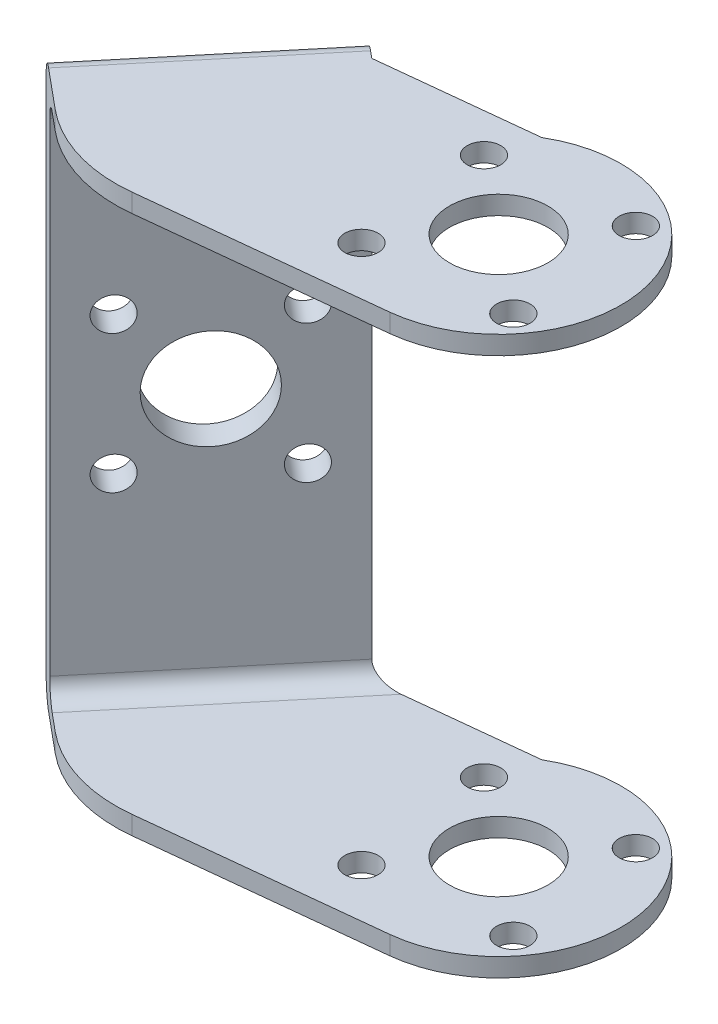
ISO-10303-21;
HEADER;
FILE_DESCRIPTION(('STEP AP214'),'2;1');
FILE_NAME('part.step','',(''),(''),'','','');
FILE_SCHEMA(('AUTOMOTIVE_DESIGN { 1 0 10303 214 1 1 1 1 }'));
ENDSEC;
DATA;
#1=APPLICATION_CONTEXT('core data for automotive mechanical design processes');
#2=APPLICATION_PROTOCOL_DEFINITION('international standard','automotive_design',2000,#1);
#3=PRODUCT_CONTEXT('',#1,'mechanical');
#4=PRODUCT('Part','Part','',(#3));
#5=PRODUCT_RELATED_PRODUCT_CATEGORY('part','',(#4));
#6=PRODUCT_DEFINITION_FORMATION('','',#4);
#7=PRODUCT_DEFINITION_CONTEXT('part definition',#1,'design');
#8=PRODUCT_DEFINITION('design','',#6,#7);
#9=PRODUCT_DEFINITION_SHAPE('','',#8);
#10=(LENGTH_UNIT() NAMED_UNIT(*) SI_UNIT(.MILLI.,.METRE.));
#11=(NAMED_UNIT(*) PLANE_ANGLE_UNIT() SI_UNIT($,.RADIAN.));
#12=(NAMED_UNIT(*) SI_UNIT($,.STERADIAN.) SOLID_ANGLE_UNIT());
#13=UNCERTAINTY_MEASURE_WITH_UNIT(LENGTH_MEASURE(1.E-05),#10,'distance_accuracy_value','');
#14=(GEOMETRIC_REPRESENTATION_CONTEXT(3) GLOBAL_UNCERTAINTY_ASSIGNED_CONTEXT((#13)) GLOBAL_UNIT_ASSIGNED_CONTEXT((#10,
#11,#12)) REPRESENTATION_CONTEXT('',''));
#15=CARTESIAN_POINT('',(0.,0.,0.));
#16=DIRECTION('',(0.,0.,1.));
#17=DIRECTION('',(1.,0.,0.));
#18=AXIS2_PLACEMENT_3D('',#15,#16,#17);
#19=CARTESIAN_POINT('',(-10.9502887226159,0.,-9.10426289269159));
#20=DIRECTION('',(0.768945255906317,0.,0.6393146278783));
#21=DIRECTION('',(0.6393146278783,0.,-0.768945255906317));
#22=AXIS2_PLACEMENT_3D('',#19,#20,#21);
#23=PLANE('',#22);
#24=CARTESIAN_POINT('',(-13.6738232846157,37.4246212024587,-5.82849085585136));
#25=DIRECTION('',(0.768945255906317,0.,0.6393146278783));
#26=DIRECTION('',(0.6393146278783,0.,-0.768945255906317));
#27=AXIS2_PLACEMENT_3D('',#24,#25,#26);
#28=CIRCLE('',#27,1.8);
#29=CARTESIAN_POINT('',(-12.5230569544348,37.4246212024587,-7.21259231648273));
#30=VERTEX_POINT('',#29);
#31=EDGE_CURVE('E371',#30,#30,#28,.F.);
#32=ORIENTED_EDGE('',*,*,#31,.T.);
#33=EDGE_LOOP('',(#32));
#34=FACE_BOUND('',#33,.T.);
#35=CARTESIAN_POINT('',(-13.6738232846157,22.5753787975412,-5.82849085585134));
#36=DIRECTION('',(0.768945255906317,0.,0.6393146278783));
#37=DIRECTION('',(0.6393146278783,0.,-0.768945255906317));
#38=AXIS2_PLACEMENT_3D('',#35,#36,#37);
#39=CIRCLE('',#38,1.8);
#40=CARTESIAN_POINT('',(-12.5230569544348,22.5753787975412,-7.21259231648271));
#41=VERTEX_POINT('',#40);
#42=EDGE_CURVE('E380',#41,#41,#39,.F.);
#43=ORIENTED_EDGE('',*,*,#42,.T.);
#44=EDGE_LOOP('',(#43));
#45=FACE_BOUND('',#44,.T.);
#46=CARTESIAN_POINT('',(-23.1671611669902,22.5753787975413,5.58976364521287));
#47=DIRECTION('',(0.768945255906317,0.,0.6393146278783));
#48=DIRECTION('',(0.6393146278783,0.,-0.768945255906317));
#49=AXIS2_PLACEMENT_3D('',#46,#47,#48);
#50=CIRCLE('',#49,1.8);
#51=CARTESIAN_POINT('',(-22.0163948368093,22.5753787975413,4.2056621845815));
#52=VERTEX_POINT('',#51);
#53=EDGE_CURVE('E383',#52,#52,#50,.F.);
#54=ORIENTED_EDGE('',*,*,#53,.T.);
#55=EDGE_LOOP('',(#54));
#56=FACE_BOUND('',#55,.T.);
#57=CARTESIAN_POINT('',(-23.1671611669902,37.4246212024588,5.58976364521286));
#58=DIRECTION('',(0.768945255906317,0.,0.6393146278783));
#59=DIRECTION('',(0.6393146278783,0.,-0.768945255906317));
#60=AXIS2_PLACEMENT_3D('',#57,#58,#59);
#61=CIRCLE('',#60,1.8);
#62=CARTESIAN_POINT('',(-22.0163948368093,37.4246212024588,4.20566218458149));
#63=VERTEX_POINT('',#62);
#64=EDGE_CURVE('E386',#63,#63,#61,.F.);
#65=ORIENTED_EDGE('',*,*,#64,.T.);
#66=EDGE_LOOP('',(#65));
#67=FACE_BOUND('',#66,.T.);
#68=CARTESIAN_POINT('',(-18.420492225803,30.,-0.119363605319243));
#69=DIRECTION('',(0.768945255906317,0.,0.6393146278783));
#70=DIRECTION('',(0.6393146278783,0.,-0.768945255906317));
#71=AXIS2_PLACEMENT_3D('',#68,#69,#70);
#72=CIRCLE('',#71,5.39999999999999);
#73=CARTESIAN_POINT('',(-14.9681932352602,30.,-4.27166798721335));
#74=VERTEX_POINT('',#73);
#75=EDGE_CURVE('E389',#74,#74,#72,.F.);
#76=ORIENTED_EDGE('',*,*,#75,.T.);
#77=EDGE_LOOP('',(#76));
#78=FACE_BOUND('',#77,.T.);
#79=DIRECTION('',(0.,-1.,0.));
#80=VECTOR('',#79,1.);
#81=CARTESIAN_POINT('',(-10.5537257297605,0.,-9.58123497924646));
#82=LINE('',#81,#80);
#83=CARTESIAN_POINT('',(-10.5537257297605,56.,-9.58123497924646));
#84=VERTEX_POINT('',#83);
#85=CARTESIAN_POINT('',(-10.5537257297605,4.,-9.58123497924646));
#86=VERTEX_POINT('',#85);
#87=EDGE_CURVE('E195',#84,#86,#82,.T.);
#88=ORIENTED_EDGE('',*,*,#87,.F.);
#89=DIRECTION('',(-0.6393146278783,0.,0.768945255906317));
#90=VECTOR('',#89,1.);
#91=CARTESIAN_POINT('',(-10.9502887226159,56.,-9.10426289269159));
#92=LINE('',#91,#90);
#93=CARTESIAN_POINT('',(-26.2872587218455,56.,9.34250776860799));
#94=VERTEX_POINT('',#93);
#95=EDGE_CURVE('E300',#84,#94,#92,.T.);
#96=ORIENTED_EDGE('',*,*,#95,.T.);
#97=DIRECTION('',(0.,1.,0.));
#98=VECTOR('',#97,1.);
#99=CARTESIAN_POINT('',(-26.2872587218455,0.,9.34250776860799));
#100=LINE('',#99,#98);
#101=CARTESIAN_POINT('',(-26.2872587218455,4.,9.34250776860799));
#102=VERTEX_POINT('',#101);
#103=EDGE_CURVE('E201',#102,#94,#100,.T.);
#104=ORIENTED_EDGE('',*,*,#103,.F.);
#105=DIRECTION('',(-0.6393146278783,0.,0.768945255906317));
#106=VECTOR('',#105,1.);
#107=CARTESIAN_POINT('',(-10.5537257297605,4.,-9.58123497924646));
#108=LINE('',#107,#106);
#109=EDGE_CURVE('E297',#102,#86,#108,.F.);
#110=ORIENTED_EDGE('',*,*,#109,.T.);
#111=EDGE_LOOP('',(#88,#96,#104,#110));
#112=FACE_BOUND('',#111,.T.);
#113=ADVANCED_FACE('F32',(#34,#45,#56,#67,#78,#112),#23,.T.);
#114=CARTESIAN_POINT('',(-12.685,2.,0.));
#115=DIRECTION('',(0.,1.,0.));
#116=DIRECTION('',(0.,0.,1.));
#117=AXIS2_PLACEMENT_3D('',#114,#115,#116);
#118=PLANE('',#117);
#119=CARTESIAN_POINT('',(4.51238048285324,2.,-6.59229021114451));
#120=DIRECTION('',(0.,1.,0.));
#121=DIRECTION('',(0.,0.,1.));
#122=AXIS2_PLACEMENT_3D('',#119,#120,#121);
#123=CIRCLE('',#122,1.8);
#124=CARTESIAN_POINT('',(4.51238048285324,2.,-4.79229021114451));
#125=VERTEX_POINT('',#124);
#126=EDGE_CURVE('E210',#125,#125,#123,.T.);
#127=ORIENTED_EDGE('',*,*,#126,.F.);
#128=EDGE_LOOP('',(#127));
#129=FACE_BOUND('',#128,.T.);
#130=CARTESIAN_POINT('',(19.2772902111445,2.,-8.17261951714677));
#131=DIRECTION('',(0.,1.,0.));
#132=DIRECTION('',(0.,0.,1.));
#133=AXIS2_PLACEMENT_3D('',#130,#131,#132);
#134=CIRCLE('',#133,1.8);
#135=CARTESIAN_POINT('',(19.2772902111445,2.,-6.37261951714677));
#136=VERTEX_POINT('',#135);
#137=EDGE_CURVE('E214',#136,#136,#134,.T.);
#138=ORIENTED_EDGE('',*,*,#137,.F.);
#139=EDGE_LOOP('',(#138));
#140=FACE_BOUND('',#139,.T.);
#141=CARTESIAN_POINT('',(20.8576195171468,2.,6.5922902111445));
#142=DIRECTION('',(0.,1.,0.));
#143=DIRECTION('',(0.,0.,1.));
#144=AXIS2_PLACEMENT_3D('',#141,#142,#143);
#145=CIRCLE('',#144,1.8);
#146=CARTESIAN_POINT('',(20.8576195171468,2.,8.3922902111445));
#147=VERTEX_POINT('',#146);
#148=EDGE_CURVE('E220',#147,#147,#145,.T.);
#149=ORIENTED_EDGE('',*,*,#148,.F.);
#150=EDGE_LOOP('',(#149));
#151=FACE_BOUND('',#150,.T.);
#152=CARTESIAN_POINT('',(6.09270978885549,2.,8.17261951714677));
#153=DIRECTION('',(0.,1.,0.));
#154=DIRECTION('',(0.,0.,1.));
#155=AXIS2_PLACEMENT_3D('',#152,#153,#154);
#156=CIRCLE('',#155,1.8);
#157=CARTESIAN_POINT('',(6.09270978885549,2.,9.97261951714676));
#158=VERTEX_POINT('',#157);
#159=EDGE_CURVE('E226',#158,#158,#156,.T.);
#160=ORIENTED_EDGE('',*,*,#159,.F.);
#161=EDGE_LOOP('',(#160));
#162=FACE_BOUND('',#161,.T.);
#163=DIRECTION('',(-0.994320742141141,0.,0.106424911312576));
#164=VECTOR('',#163,1.);
#165=CARTESIAN_POINT('',(-10.5537257297605,2.,-9.58123497924646));
#166=LINE('',#165,#164);
#167=CARTESIAN_POINT('',(5.98794999616358,2.,-11.3517364859353));
#168=VERTEX_POINT('',#167);
#169=CARTESIAN_POINT('',(-7.69869410826487,2.,-9.88681694514005));
#170=VERTEX_POINT('',#169);
#171=EDGE_CURVE('E249',#168,#170,#166,.T.);
#172=ORIENTED_EDGE('',*,*,#171,.T.);
#173=DIRECTION('',(-0.6393146278783,0.,0.768945255906317));
#174=VECTOR('',#173,1.);
#175=CARTESIAN_POINT('',(-24.7493682100328,2.,10.6211370243646));
#176=LINE('',#175,#174);
#177=CARTESIAN_POINT('',(-24.7493682100328,2.,10.6211370243646));
#178=VERTEX_POINT('',#177);
#179=EDGE_CURVE('E304',#170,#178,#176,.T.);
#180=ORIENTED_EDGE('',*,*,#179,.T.);
#181=DIRECTION('',(0.768945255906318,0.,0.639314627878299));
#182=VECTOR('',#181,1.);
#183=CARTESIAN_POINT('',(-22.8373162907074,2.,12.2108506637923));
#184=LINE('',#183,#182);
#185=CARTESIAN_POINT('',(-22.8373162907074,2.,12.2108506637923));
#186=VERTEX_POINT('',#185);
#187=EDGE_CURVE('E252',#178,#186,#184,.T.);
#188=ORIENTED_EDGE('',*,*,#187,.T.);
#189=CARTESIAN_POINT('',(-12.685,2.,0.));
#190=DIRECTION('',(0.,1.,0.));
#191=DIRECTION('',(0.,0.,1.));
#192=AXIS2_PLACEMENT_3D('',#189,#190,#191);
#193=CIRCLE('',#192,15.88);
#194=CARTESIAN_POINT('',(-10.9949724083563,2.,15.7898133852013));
#195=VERTEX_POINT('',#194);
#196=EDGE_CURVE('E241',#186,#195,#193,.T.);
#197=ORIENTED_EDGE('',*,*,#196,.T.);
#198=DIRECTION('',(0.994320742141142,0.,-0.106424911312574));
#199=VECTOR('',#198,1.);
#200=CARTESIAN_POINT('',(-10.9949724083563,2.,15.7898133852013));
#201=LINE('',#200,#199);
#202=CARTESIAN_POINT('',(14.0876803310997,2.,13.1051473814202));
#203=VERTEX_POINT('',#202);
#204=EDGE_CURVE('E244',#195,#203,#201,.T.);
#205=ORIENTED_EDGE('',*,*,#204,.T.);
#206=CARTESIAN_POINT('',(12.685,2.,0.));
#207=DIRECTION('',(0.,1.,0.));
#208=DIRECTION('',(0.,0.,1.));
#209=AXIS2_PLACEMENT_3D('',#206,#207,#208);
#210=CIRCLE('',#209,13.18);
#211=EDGE_CURVE('E247',#203,#168,#210,.T.);
#212=ORIENTED_EDGE('',*,*,#211,.T.);
#213=EDGE_LOOP('',(#172,#180,#188,#197,#205,#212));
#214=FACE_BOUND('',#213,.T.);
#215=CARTESIAN_POINT('',(12.685,2.,0.));
#216=DIRECTION('',(0.,1.,0.));
#217=DIRECTION('',(0.,0.,1.));
#218=AXIS2_PLACEMENT_3D('',#215,#216,#217);
#219=CIRCLE('',#218,5.3);
#220=CARTESIAN_POINT('',(12.685,2.,5.3));
#221=VERTEX_POINT('',#220);
#222=EDGE_CURVE('E235',#221,#221,#219,.T.);
#223=ORIENTED_EDGE('',*,*,#222,.F.);
#224=EDGE_LOOP('',(#223));
#225=FACE_BOUND('',#224,.T.);
#226=ADVANCED_FACE('F327',(#129,#140,#151,#162,#214,#225),#118,.T.);
#227=CARTESIAN_POINT('',(-12.685,0.,0.));
#228=DIRECTION('',(0.,1.,0.));
#229=DIRECTION('',(0.,0.,1.));
#230=AXIS2_PLACEMENT_3D('',#227,#228,#229);
#231=PLANE('',#230);
#232=CARTESIAN_POINT('',(4.51238048285324,0.,-6.59229021114451));
#233=DIRECTION('',(0.,1.,0.));
#234=DIRECTION('',(0.,0.,1.));
#235=AXIS2_PLACEMENT_3D('',#232,#233,#234);
#236=CIRCLE('',#235,1.8);
#237=CARTESIAN_POINT('',(4.51238048285324,0.,-4.79229021114451));
#238=VERTEX_POINT('',#237);
#239=EDGE_CURVE('E211',#238,#238,#236,.T.);
#240=ORIENTED_EDGE('',*,*,#239,.T.);
#241=EDGE_LOOP('',(#240));
#242=FACE_BOUND('',#241,.T.);
#243=CARTESIAN_POINT('',(19.2772902111445,0.,-8.17261951714677));
#244=DIRECTION('',(0.,1.,0.));
#245=DIRECTION('',(0.,0.,1.));
#246=AXIS2_PLACEMENT_3D('',#243,#244,#245);
#247=CIRCLE('',#246,1.8);
#248=CARTESIAN_POINT('',(19.2772902111445,0.,-6.37261951714677));
#249=VERTEX_POINT('',#248);
#250=EDGE_CURVE('E217',#249,#249,#247,.T.);
#251=ORIENTED_EDGE('',*,*,#250,.T.);
#252=EDGE_LOOP('',(#251));
#253=FACE_BOUND('',#252,.T.);
#254=CARTESIAN_POINT('',(20.8576195171468,0.,6.5922902111445));
#255=DIRECTION('',(0.,1.,0.));
#256=DIRECTION('',(0.,0.,1.));
#257=AXIS2_PLACEMENT_3D('',#254,#255,#256);
#258=CIRCLE('',#257,1.8);
#259=CARTESIAN_POINT('',(20.8576195171468,0.,8.3922902111445));
#260=VERTEX_POINT('',#259);
#261=EDGE_CURVE('E223',#260,#260,#258,.T.);
#262=ORIENTED_EDGE('',*,*,#261,.T.);
#263=EDGE_LOOP('',(#262));
#264=FACE_BOUND('',#263,.T.);
#265=CARTESIAN_POINT('',(6.09270978885549,0.,8.17261951714677));
#266=DIRECTION('',(0.,1.,0.));
#267=DIRECTION('',(0.,0.,1.));
#268=AXIS2_PLACEMENT_3D('',#265,#266,#267);
#269=CIRCLE('',#268,1.8);
#270=CARTESIAN_POINT('',(6.09270978885549,0.,9.97261951714676));
#271=VERTEX_POINT('',#270);
#272=EDGE_CURVE('E229',#271,#271,#269,.T.);
#273=ORIENTED_EDGE('',*,*,#272,.T.);
#274=EDGE_LOOP('',(#273));
#275=FACE_BOUND('',#274,.T.);
#276=DIRECTION('',(0.768945255906318,0.,0.639314627878299));
#277=VECTOR('',#276,1.);
#278=CARTESIAN_POINT('',(-22.8373162907074,0.,12.2108506637923));
#279=LINE('',#278,#277);
#280=CARTESIAN_POINT('',(-27.0562039777518,0.,8.70319314072968));
#281=VERTEX_POINT('',#280);
#282=CARTESIAN_POINT('',(-22.8373162907074,0.,12.2108506637923));
#283=VERTEX_POINT('',#282);
#284=EDGE_CURVE('E245',#281,#283,#279,.T.);
#285=ORIENTED_EDGE('',*,*,#284,.F.);
#286=DIRECTION('',(0.6393146278783,0.,-0.768945255906317));
#287=VECTOR('',#286,1.);
#288=CARTESIAN_POINT('',(-16.9038876870444,0.,-3.50765752306264));
#289=LINE('',#288,#287);
#290=CARTESIAN_POINT('',(-11.3226709856668,0.,-10.2205496071248));
#291=VERTEX_POINT('',#290);
#292=EDGE_CURVE('E279',#281,#291,#289,.T.);
#293=ORIENTED_EDGE('',*,*,#292,.T.);
#294=DIRECTION('',(0.768945255906316,0.,0.6393146278783));
#295=VECTOR('',#294,1.);
#296=CARTESIAN_POINT('',(-12.0916162415731,0.,-10.8598642350031));
#297=LINE('',#296,#295);
#298=CARTESIAN_POINT('',(-10.5537257297605,0.,-9.58123497924646));
#299=VERTEX_POINT('',#298);
#300=EDGE_CURVE('E208',#291,#299,#297,.T.);
#301=ORIENTED_EDGE('',*,*,#300,.T.);
#302=DIRECTION('',(-0.994320742141141,0.,0.106424911312576));
#303=VECTOR('',#302,1.);
#304=CARTESIAN_POINT('',(-10.5537257297605,0.,-9.58123497924646));
#305=LINE('',#304,#303);
#306=CARTESIAN_POINT('',(5.98794999616358,0.,-11.3517364859353));
#307=VERTEX_POINT('',#306);
#308=EDGE_CURVE('E261',#307,#299,#305,.T.);
#309=ORIENTED_EDGE('',*,*,#308,.F.);
#310=CARTESIAN_POINT('',(12.685,0.,0.));
#311=DIRECTION('',(0.,1.,0.));
#312=DIRECTION('',(0.,0.,1.));
#313=AXIS2_PLACEMENT_3D('',#310,#311,#312);
#314=CIRCLE('',#313,13.18);
#315=CARTESIAN_POINT('',(14.0876803310997,0.,13.1051473814202));
#316=VERTEX_POINT('',#315);
#317=EDGE_CURVE('E259',#316,#307,#314,.T.);
#318=ORIENTED_EDGE('',*,*,#317,.F.);
#319=DIRECTION('',(0.994320742141142,0.,-0.106424911312574));
#320=VECTOR('',#319,1.);
#321=CARTESIAN_POINT('',(-10.9949724083563,0.,15.7898133852013));
#322=LINE('',#321,#320);
#323=CARTESIAN_POINT('',(-10.9949724083563,0.,15.7898133852013));
#324=VERTEX_POINT('',#323);
#325=EDGE_CURVE('E257',#324,#316,#322,.T.);
#326=ORIENTED_EDGE('',*,*,#325,.F.);
#327=CARTESIAN_POINT('',(-12.685,0.,0.));
#328=DIRECTION('',(0.,1.,0.));
#329=DIRECTION('',(0.,0.,1.));
#330=AXIS2_PLACEMENT_3D('',#327,#328,#329);
#331=CIRCLE('',#330,15.88);
#332=EDGE_CURVE('E238',#283,#324,#331,.T.);
#333=ORIENTED_EDGE('',*,*,#332,.F.);
#334=EDGE_LOOP('',(#285,#293,#301,#309,#318,#326,#333));
#335=FACE_BOUND('',#334,.T.);
#336=CARTESIAN_POINT('',(12.685,0.,0.));
#337=DIRECTION('',(0.,1.,0.));
#338=DIRECTION('',(0.,0.,1.));
#339=AXIS2_PLACEMENT_3D('',#336,#337,#338);
#340=CIRCLE('',#339,5.3);
#341=CARTESIAN_POINT('',(12.685,0.,5.3));
#342=VERTEX_POINT('',#341);
#343=EDGE_CURVE('E232',#342,#342,#340,.T.);
#344=ORIENTED_EDGE('',*,*,#343,.T.);
#345=EDGE_LOOP('',(#344));
#346=FACE_BOUND('',#345,.T.);
#347=ADVANCED_FACE('F338',(#242,#253,#264,#275,#335,#346),#231,.F.);
#348=CARTESIAN_POINT('',(-12.685,2.,0.));
#349=DIRECTION('',(0.,-1.,0.));
#350=DIRECTION('',(0.,0.,-1.));
#351=AXIS2_PLACEMENT_3D('',#348,#349,#350);
#352=CYLINDRICAL_SURFACE('',#351,15.88);
#353=ORIENTED_EDGE('',*,*,#332,.T.);
#354=DIRECTION('',(0.,-1.,0.));
#355=VECTOR('',#354,1.);
#356=CARTESIAN_POINT('',(-10.9949724083563,2.,15.7898133852013));
#357=LINE('',#356,#355);
#358=EDGE_CURVE('E276',#195,#324,#357,.T.);
#359=ORIENTED_EDGE('',*,*,#358,.F.);
#360=ORIENTED_EDGE('',*,*,#196,.F.);
#361=DIRECTION('',(0.,-1.,0.));
#362=VECTOR('',#361,1.);
#363=CARTESIAN_POINT('',(-22.8373162907074,2.,12.2108506637923));
#364=LINE('',#363,#362);
#365=EDGE_CURVE('E254',#186,#283,#364,.T.);
#366=ORIENTED_EDGE('',*,*,#365,.T.);
#367=EDGE_LOOP('',(#353,#359,#360,#366));
#368=FACE_BOUND('',#367,.T.);
#369=ADVANCED_FACE('F530',(#368),#352,.T.);
#370=CARTESIAN_POINT('',(-10.9949724083563,2.,15.7898133852013));
#371=DIRECTION('',(-0.106424911312574,0.,-0.994320742141142));
#372=DIRECTION('',(-0.994320742141142,0.,0.106424911312574));
#373=AXIS2_PLACEMENT_3D('',#370,#371,#372);
#374=PLANE('',#373);
#375=ORIENTED_EDGE('',*,*,#325,.T.);
#376=DIRECTION('',(0.,-1.,0.));
#377=VECTOR('',#376,1.);
#378=CARTESIAN_POINT('',(14.0876803310997,2.,13.1051473814202));
#379=LINE('',#378,#377);
#380=EDGE_CURVE('E273',#203,#316,#379,.T.);
#381=ORIENTED_EDGE('',*,*,#380,.F.);
#382=ORIENTED_EDGE('',*,*,#204,.F.);
#383=ORIENTED_EDGE('',*,*,#358,.T.);
#384=EDGE_LOOP('',(#375,#381,#382,#383));
#385=FACE_BOUND('',#384,.T.);
#386=ADVANCED_FACE('F762',(#385),#374,.F.);
#387=CARTESIAN_POINT('',(12.685,2.,0.));
#388=DIRECTION('',(0.,-1.,0.));
#389=DIRECTION('',(0.,0.,-1.));
#390=AXIS2_PLACEMENT_3D('',#387,#388,#389);
#391=CYLINDRICAL_SURFACE('',#390,13.18);
#392=ORIENTED_EDGE('',*,*,#317,.T.);
#393=DIRECTION('',(0.,-1.,0.));
#394=VECTOR('',#393,1.);
#395=CARTESIAN_POINT('',(5.98794999616358,2.,-11.3517364859353));
#396=LINE('',#395,#394);
#397=EDGE_CURVE('E270',#168,#307,#396,.T.);
#398=ORIENTED_EDGE('',*,*,#397,.F.);
#399=ORIENTED_EDGE('',*,*,#211,.F.);
#400=ORIENTED_EDGE('',*,*,#380,.T.);
#401=EDGE_LOOP('',(#392,#398,#399,#400));
#402=FACE_BOUND('',#401,.T.);
#403=ADVANCED_FACE('F333',(#402),#391,.T.);
#404=CARTESIAN_POINT('',(-10.5537257297605,2.,-9.58123497924646));
#405=DIRECTION('',(0.106424911312576,0.,0.994320742141141));
#406=DIRECTION('',(0.994320742141142,0.,-0.106424911312576));
#407=AXIS2_PLACEMENT_3D('',#404,#405,#406);
#408=PLANE('',#407);
#409=ORIENTED_EDGE('',*,*,#308,.T.);
#410=DIRECTION('',(0.,-1.,0.));
#411=VECTOR('',#410,1.);
#412=CARTESIAN_POINT('',(-10.5537257297605,2.,-9.58123497924646));
#413=LINE('',#412,#411);
#414=EDGE_CURVE('E267',#86,#299,#413,.T.);
#415=ORIENTED_EDGE('',*,*,#414,.F.);
#416=CARTESIAN_POINT('',(-7.69869410826487,4.,-9.88681694514005));
#417=DIRECTION('',(0.106424911312576,0.,0.994320742141141));
#418=DIRECTION('',(0.994320742141142,0.,-0.106424911312576));
#419=AXIS2_PLACEMENT_3D('',#416,#417,#418);
#420=ELLIPSE('',#419,2.87133869434091,2.);
#421=EDGE_CURVE('E11',#86,#170,#420,.T.);
#422=ORIENTED_EDGE('',*,*,#421,.T.);
#423=ORIENTED_EDGE('',*,*,#171,.F.);
#424=ORIENTED_EDGE('',*,*,#397,.T.);
#425=EDGE_LOOP('',(#409,#415,#422,#423,#424));
#426=FACE_BOUND('',#425,.T.);
#427=ADVANCED_FACE('F325',(#426),#408,.F.);
#428=CARTESIAN_POINT('',(-22.8373162907074,2.,12.2108506637923));
#429=DIRECTION('',(0.639314627878299,0.,-0.768945255906318));
#430=DIRECTION('',(-0.768945255906318,0.,-0.639314627878299));
#431=AXIS2_PLACEMENT_3D('',#428,#429,#430);
#432=PLANE('',#431);
#433=DIRECTION('',(0.,-1.,0.));
#434=VECTOR('',#433,1.);
#435=CARTESIAN_POINT('',(-28.5940944895644,0.,7.42456388497308));
#436=LINE('',#435,#434);
#437=CARTESIAN_POINT('',(-28.5940944895644,58.,7.42456388497308));
#438=VERTEX_POINT('',#437);
#439=CARTESIAN_POINT('',(-28.5940944895644,2.,7.42456388497308));
#440=VERTEX_POINT('',#439);
#441=EDGE_CURVE('E368',#438,#440,#436,.T.);
#442=ORIENTED_EDGE('',*,*,#441,.T.);
#443=CARTESIAN_POINT('',(-27.0562039777518,2.,8.70319314072968));
#444=DIRECTION('',(0.639314627878299,0.,-0.768945255906318));
#445=DIRECTION('',(-0.768945255906318,0.,-0.639314627878299));
#446=AXIS2_PLACEMENT_3D('',#443,#444,#445);
#447=CIRCLE('',#446,2.);
#448=EDGE_CURVE('E292',#440,#281,#447,.F.);
#449=ORIENTED_EDGE('',*,*,#448,.T.);
#450=ORIENTED_EDGE('',*,*,#284,.T.);
#451=ORIENTED_EDGE('',*,*,#365,.F.);
#452=ORIENTED_EDGE('',*,*,#187,.F.);
#453=CARTESIAN_POINT('',(-24.7493682100328,4.,10.6211370243646));
#454=DIRECTION('',(0.639314627878299,0.,-0.768945255906318));
#455=DIRECTION('',(-0.768945255906318,0.,-0.639314627878299));
#456=AXIS2_PLACEMENT_3D('',#453,#454,#455);
#457=CIRCLE('',#456,2.);
#458=EDGE_CURVE('E41',#178,#102,#457,.T.);
#459=ORIENTED_EDGE('',*,*,#458,.T.);
#460=ORIENTED_EDGE('',*,*,#103,.T.);
#461=CARTESIAN_POINT('',(-24.7493682100328,56.,10.6211370243646));
#462=DIRECTION('',(0.639314627878299,0.,-0.768945255906318));
#463=DIRECTION('',(-0.768945255906318,0.,-0.639314627878299));
#464=AXIS2_PLACEMENT_3D('',#461,#462,#463);
#465=CIRCLE('',#464,2.);
#466=CARTESIAN_POINT('',(-24.7493682100328,58.,10.6211370243646));
#467=VERTEX_POINT('',#466);
#468=EDGE_CURVE('E307',#94,#467,#465,.T.);
#469=ORIENTED_EDGE('',*,*,#468,.T.);
#470=DIRECTION('',(0.768945255906318,0.,0.639314627878298));
#471=VECTOR('',#470,1.);
#472=CARTESIAN_POINT('',(-26.2872587218455,58.,9.34250776860799));
#473=LINE('',#472,#471);
#474=CARTESIAN_POINT('',(-22.8373162907074,58.,12.2108506637923));
#475=VERTEX_POINT('',#474);
#476=EDGE_CURVE('E170',#467,#475,#473,.T.);
#477=ORIENTED_EDGE('',*,*,#476,.T.);
#478=DIRECTION('',(0.,1.,0.));
#479=VECTOR('',#478,1.);
#480=CARTESIAN_POINT('',(-22.8373162907074,58.,12.2108506637923));
#481=LINE('',#480,#479);
#482=CARTESIAN_POINT('',(-22.8373162907074,60.,12.2108506637923));
#483=VERTEX_POINT('',#482);
#484=EDGE_CURVE('E158',#475,#483,#481,.T.);
#485=ORIENTED_EDGE('',*,*,#484,.T.);
#486=DIRECTION('',(0.768945255906316,0.,0.6393146278783));
#487=VECTOR('',#486,1.);
#488=CARTESIAN_POINT('',(-27.8251492336581,60.,8.06387851285139));
#489=LINE('',#488,#487);
#490=CARTESIAN_POINT('',(-27.0562039777518,60.,8.70319314072968));
#491=VERTEX_POINT('',#490);
#492=EDGE_CURVE('E206',#491,#483,#489,.T.);
#493=ORIENTED_EDGE('',*,*,#492,.F.);
#494=CARTESIAN_POINT('',(-27.0562039777518,58.,8.70319314072968));
#495=DIRECTION('',(0.639314627878299,0.,-0.768945255906318));
#496=DIRECTION('',(-0.768945255906318,0.,-0.639314627878299));
#497=AXIS2_PLACEMENT_3D('',#494,#495,#496);
#498=CIRCLE('',#497,2.);
#499=EDGE_CURVE('E290',#491,#438,#498,.F.);
#500=ORIENTED_EDGE('',*,*,#499,.T.);
#501=EDGE_LOOP('',(#442,#449,#450,#451,#452,#459,#460,#469,#477,#485,#493,#500));
#502=FACE_BOUND('',#501,.T.);
#503=ADVANCED_FACE('F314',(#502),#432,.F.);
#504=CARTESIAN_POINT('',(12.685,2.,0.));
#505=DIRECTION('',(0.,-1.,0.));
#506=DIRECTION('',(0.,0.,-1.));
#507=AXIS2_PLACEMENT_3D('',#504,#505,#506);
#508=CYLINDRICAL_SURFACE('',#507,5.3);
#509=ORIENTED_EDGE('',*,*,#222,.T.);
#510=EDGE_LOOP('',(#509));
#511=FACE_BOUND('',#510,.T.);
#512=ORIENTED_EDGE('',*,*,#343,.F.);
#513=EDGE_LOOP('',(#512));
#514=FACE_BOUND('',#513,.T.);
#515=ADVANCED_FACE('F594',(#511,#514),#508,.F.);
#516=CARTESIAN_POINT('',(6.09270978885549,0.,8.17261951714677));
#517=DIRECTION('',(0.,1.,0.));
#518=DIRECTION('',(0.,0.,1.));
#519=AXIS2_PLACEMENT_3D('',#516,#517,#518);
#520=CYLINDRICAL_SURFACE('',#519,1.8);
#521=ORIENTED_EDGE('',*,*,#272,.F.);
#522=EDGE_LOOP('',(#521));
#523=FACE_BOUND('',#522,.T.);
#524=ORIENTED_EDGE('',*,*,#159,.T.);
#525=EDGE_LOOP('',(#524));
#526=FACE_BOUND('',#525,.T.);
#527=ADVANCED_FACE('F737',(#523,#526),#520,.F.);
#528=CARTESIAN_POINT('',(20.8576195171468,0.,6.5922902111445));
#529=DIRECTION('',(0.,1.,0.));
#530=DIRECTION('',(0.,0.,1.));
#531=AXIS2_PLACEMENT_3D('',#528,#529,#530);
#532=CYLINDRICAL_SURFACE('',#531,1.8);
#533=ORIENTED_EDGE('',*,*,#261,.F.);
#534=EDGE_LOOP('',(#533));
#535=FACE_BOUND('',#534,.T.);
#536=ORIENTED_EDGE('',*,*,#148,.T.);
#537=EDGE_LOOP('',(#536));
#538=FACE_BOUND('',#537,.T.);
#539=ADVANCED_FACE('F727',(#535,#538),#532,.F.);
#540=CARTESIAN_POINT('',(19.2772902111445,0.,-8.17261951714677));
#541=DIRECTION('',(0.,1.,0.));
#542=DIRECTION('',(0.,0.,1.));
#543=AXIS2_PLACEMENT_3D('',#540,#541,#542);
#544=CYLINDRICAL_SURFACE('',#543,1.8);
#545=ORIENTED_EDGE('',*,*,#250,.F.);
#546=EDGE_LOOP('',(#545));
#547=FACE_BOUND('',#546,.T.);
#548=ORIENTED_EDGE('',*,*,#137,.T.);
#549=EDGE_LOOP('',(#548));
#550=FACE_BOUND('',#549,.T.);
#551=ADVANCED_FACE('F717',(#547,#550),#544,.F.);
#552=CARTESIAN_POINT('',(4.51238048285324,0.,-6.59229021114451));
#553=DIRECTION('',(0.,1.,0.));
#554=DIRECTION('',(0.,0.,1.));
#555=AXIS2_PLACEMENT_3D('',#552,#553,#554);
#556=CYLINDRICAL_SURFACE('',#555,1.8);
#557=ORIENTED_EDGE('',*,*,#239,.F.);
#558=EDGE_LOOP('',(#557));
#559=FACE_BOUND('',#558,.T.);
#560=ORIENTED_EDGE('',*,*,#126,.T.);
#561=EDGE_LOOP('',(#560));
#562=FACE_BOUND('',#561,.T.);
#563=ADVANCED_FACE('F431',(#559,#562),#556,.F.);
#564=CARTESIAN_POINT('',(-12.0916162415731,0.,-10.8598642350031));
#565=DIRECTION('',(-0.6393146278783,0.,0.768945255906316));
#566=DIRECTION('',(0.768945255906317,0.,0.6393146278783));
#567=AXIS2_PLACEMENT_3D('',#564,#565,#566);
#568=PLANE('',#567);
#569=ORIENTED_EDGE('',*,*,#300,.F.);
#570=CARTESIAN_POINT('',(-11.3226709856668,2.,-10.2205496071248));
#571=DIRECTION('',(-0.6393146278783,0.,0.768945255906316));
#572=DIRECTION('',(0.768945255906317,0.,0.6393146278783));
#573=AXIS2_PLACEMENT_3D('',#570,#571,#572);
#574=CIRCLE('',#573,2.);
#575=CARTESIAN_POINT('',(-12.8605614974795,2.,-11.4991788628814));
#576=VERTEX_POINT('',#575);
#577=EDGE_CURVE('E284',#291,#576,#574,.F.);
#578=ORIENTED_EDGE('',*,*,#577,.T.);
#579=DIRECTION('',(0.,1.,0.));
#580=VECTOR('',#579,1.);
#581=CARTESIAN_POINT('',(-12.8605614974795,0.,-11.4991788628814));
#582=LINE('',#581,#580);
#583=CARTESIAN_POINT('',(-12.8605614974795,58.,-11.4991788628814));
#584=VERTEX_POINT('',#583);
#585=EDGE_CURVE('E366',#576,#584,#582,.T.);
#586=ORIENTED_EDGE('',*,*,#585,.T.);
#587=CARTESIAN_POINT('',(-11.3226709856668,58.,-10.2205496071248));
#588=DIRECTION('',(-0.6393146278783,0.,0.768945255906316));
#589=DIRECTION('',(0.768945255906317,0.,0.6393146278783));
#590=AXIS2_PLACEMENT_3D('',#587,#588,#589);
#591=CIRCLE('',#590,2.);
#592=CARTESIAN_POINT('',(-11.3226709856668,60.,-10.2205496071248));
#593=VERTEX_POINT('',#592);
#594=EDGE_CURVE('E282',#584,#593,#591,.F.);
#595=ORIENTED_EDGE('',*,*,#594,.T.);
#596=DIRECTION('',(0.768945255906316,0.,0.6393146278783));
#597=VECTOR('',#596,1.);
#598=CARTESIAN_POINT('',(-12.0916162415731,60.,-10.8598642350031));
#599=LINE('',#598,#597);
#600=CARTESIAN_POINT('',(-10.5537257297605,60.,-9.58123497924646));
#601=VERTEX_POINT('',#600);
#602=EDGE_CURVE('E204',#593,#601,#599,.T.);
#603=ORIENTED_EDGE('',*,*,#602,.T.);
#604=EDGE_CURVE('E48',#601,#84,#82,.T.);
#605=ORIENTED_EDGE('',*,*,#604,.T.);
#606=ORIENTED_EDGE('',*,*,#87,.T.);
#607=ORIENTED_EDGE('',*,*,#414,.T.);
#608=EDGE_LOOP('',(#569,#578,#586,#595,#603,#605,#606,#607));
#609=FACE_BOUND('',#608,.T.);
#610=ADVANCED_FACE('F342',(#609),#568,.F.);
#611=CARTESIAN_POINT('',(-12.0916162415731,60.,-10.8598642350031));
#612=DIRECTION('',(0.,-1.,0.));
#613=DIRECTION('',(0.,0.,-1.));
#614=AXIS2_PLACEMENT_3D('',#611,#612,#613);
#615=PLANE('',#614);
#616=ORIENTED_EDGE('',*,*,#602,.F.);
#617=DIRECTION('',(-0.6393146278783,0.,0.768945255906317));
#618=VECTOR('',#617,1.);
#619=CARTESIAN_POINT('',(-11.3226709856668,60.,-10.2205496071248));
#620=LINE('',#619,#618);
#621=EDGE_CURVE('E294',#593,#491,#620,.T.);
#622=ORIENTED_EDGE('',*,*,#621,.T.);
#623=ORIENTED_EDGE('',*,*,#492,.T.);
#624=CARTESIAN_POINT('',(-12.685,60.,0.));
#625=DIRECTION('',(0.,1.,0.));
#626=DIRECTION('',(0.,0.,1.));
#627=AXIS2_PLACEMENT_3D('',#624,#625,#626);
#628=CIRCLE('',#627,15.88);
#629=CARTESIAN_POINT('',(-10.9949724083563,60.,15.7898133852013));
#630=VERTEX_POINT('',#629);
#631=EDGE_CURVE('E177',#483,#630,#628,.T.);
#632=ORIENTED_EDGE('',*,*,#631,.T.);
#633=DIRECTION('',(0.994320742141142,0.,-0.106424911312574));
#634=VECTOR('',#633,1.);
#635=CARTESIAN_POINT('',(14.0876803310997,60.,13.1051473814202));
#636=LINE('',#635,#634);
#637=CARTESIAN_POINT('',(14.0876803310997,60.,13.1051473814202));
#638=VERTEX_POINT('',#637);
#639=EDGE_CURVE('E174',#630,#638,#636,.T.);
#640=ORIENTED_EDGE('',*,*,#639,.T.);
#641=CARTESIAN_POINT('',(12.685,60.,0.));
#642=DIRECTION('',(0.,1.,0.));
#643=DIRECTION('',(0.,0.,1.));
#644=AXIS2_PLACEMENT_3D('',#641,#642,#643);
#645=CIRCLE('',#644,13.18);
#646=CARTESIAN_POINT('',(5.98794999616359,60.,-11.3517364859353));
#647=VERTEX_POINT('',#646);
#648=EDGE_CURVE('E188',#638,#647,#645,.T.);
#649=ORIENTED_EDGE('',*,*,#648,.T.);
#650=DIRECTION('',(-0.994320742141141,0.,0.106424911312576));
#651=VECTOR('',#650,1.);
#652=CARTESIAN_POINT('',(-10.5537257297605,60.,-9.58123497924646));
#653=LINE('',#652,#651);
#654=EDGE_CURVE('E153',#647,#601,#653,.T.);
#655=ORIENTED_EDGE('',*,*,#654,.T.);
#656=EDGE_LOOP('',(#616,#622,#623,#632,#640,#649,#655));
#657=FACE_BOUND('',#656,.T.);
#658=CARTESIAN_POINT('',(6.09270978885549,60.,8.17261951714677));
#659=DIRECTION('',(0.,1.,0.));
#660=DIRECTION('',(0.,0.,1.));
#661=AXIS2_PLACEMENT_3D('',#658,#659,#660);
#662=CIRCLE('',#661,1.8);
#663=CARTESIAN_POINT('',(6.09270978885549,60.,9.97261951714676));
#664=VERTEX_POINT('',#663);
#665=EDGE_CURVE('E392',#664,#664,#662,.T.);
#666=ORIENTED_EDGE('',*,*,#665,.F.);
#667=EDGE_LOOP('',(#666));
#668=FACE_BOUND('',#667,.T.);
#669=CARTESIAN_POINT('',(20.8576195171468,60.,6.5922902111445));
#670=DIRECTION('',(0.,1.,0.));
#671=DIRECTION('',(0.,0.,1.));
#672=AXIS2_PLACEMENT_3D('',#669,#670,#671);
#673=CIRCLE('',#672,1.8);
#674=CARTESIAN_POINT('',(20.8576195171468,60.,8.3922902111445));
#675=VERTEX_POINT('',#674);
#676=EDGE_CURVE('E396',#675,#675,#673,.T.);
#677=ORIENTED_EDGE('',*,*,#676,.F.);
#678=EDGE_LOOP('',(#677));
#679=FACE_BOUND('',#678,.T.);
#680=CARTESIAN_POINT('',(19.2772902111445,60.,-8.17261951714677));
#681=DIRECTION('',(0.,1.,0.));
#682=DIRECTION('',(0.,0.,1.));
#683=AXIS2_PLACEMENT_3D('',#680,#681,#682);
#684=CIRCLE('',#683,1.8);
#685=CARTESIAN_POINT('',(19.2772902111445,60.,-6.37261951714677));
#686=VERTEX_POINT('',#685);
#687=EDGE_CURVE('E402',#686,#686,#684,.T.);
#688=ORIENTED_EDGE('',*,*,#687,.F.);
#689=EDGE_LOOP('',(#688));
#690=FACE_BOUND('',#689,.T.);
#691=CARTESIAN_POINT('',(4.51238048285324,60.,-6.59229021114451));
#692=DIRECTION('',(0.,1.,0.));
#693=DIRECTION('',(0.,0.,1.));
#694=AXIS2_PLACEMENT_3D('',#691,#692,#693);
#695=CIRCLE('',#694,1.8);
#696=CARTESIAN_POINT('',(4.51238048285324,60.,-4.79229021114451));
#697=VERTEX_POINT('',#696);
#698=EDGE_CURVE('E408',#697,#697,#695,.T.);
#699=ORIENTED_EDGE('',*,*,#698,.F.);
#700=EDGE_LOOP('',(#699));
#701=FACE_BOUND('',#700,.T.);
#702=CARTESIAN_POINT('',(12.685,60.,0.));
#703=DIRECTION('',(0.,1.,0.));
#704=DIRECTION('',(0.,0.,1.));
#705=AXIS2_PLACEMENT_3D('',#702,#703,#704);
#706=CIRCLE('',#705,5.3);
#707=CARTESIAN_POINT('',(12.685,60.,5.3));
#708=VERTEX_POINT('',#707);
#709=EDGE_CURVE('E180',#708,#708,#706,.T.);
#710=ORIENTED_EDGE('',*,*,#709,.F.);
#711=EDGE_LOOP('',(#710));
#712=FACE_BOUND('',#711,.T.);
#713=ADVANCED_FACE('F354',(#657,#668,#679,#690,#701,#712),#615,.F.);
#714=CARTESIAN_POINT('',(12.685,58.,0.));
#715=DIRECTION('',(0.,1.,0.));
#716=DIRECTION('',(0.,0.,1.));
#717=AXIS2_PLACEMENT_3D('',#714,#715,#716);
#718=CYLINDRICAL_SURFACE('',#717,13.18);
#719=ORIENTED_EDGE('',*,*,#648,.F.);
#720=DIRECTION('',(0.,1.,0.));
#721=VECTOR('',#720,1.);
#722=CARTESIAN_POINT('',(14.0876803310997,58.,13.1051473814202));
#723=LINE('',#722,#721);
#724=CARTESIAN_POINT('',(14.0876803310997,58.,13.1051473814202));
#725=VERTEX_POINT('',#724);
#726=EDGE_CURVE('E173',#725,#638,#723,.T.);
#727=ORIENTED_EDGE('',*,*,#726,.F.);
#728=CARTESIAN_POINT('',(12.685,58.,0.));
#729=DIRECTION('',(0.,1.,0.));
#730=DIRECTION('',(0.,0.,1.));
#731=AXIS2_PLACEMENT_3D('',#728,#729,#730);
#732=CIRCLE('',#731,13.18);
#733=CARTESIAN_POINT('',(5.98794999616359,58.,-11.3517364859353));
#734=VERTEX_POINT('',#733);
#735=EDGE_CURVE('E166',#725,#734,#732,.T.);
#736=ORIENTED_EDGE('',*,*,#735,.T.);
#737=DIRECTION('',(0.,1.,0.));
#738=VECTOR('',#737,1.);
#739=CARTESIAN_POINT('',(5.98794999616359,58.,-11.3517364859353));
#740=LINE('',#739,#738);
#741=EDGE_CURVE('E146',#734,#647,#740,.T.);
#742=ORIENTED_EDGE('',*,*,#741,.T.);
#743=EDGE_LOOP('',(#719,#727,#736,#742));
#744=FACE_BOUND('',#743,.T.);
#745=ADVANCED_FACE('F172',(#744),#718,.T.);
#746=CARTESIAN_POINT('',(14.0876803310997,58.,13.1051473814202));
#747=DIRECTION('',(0.106424911312574,0.,0.994320742141142));
#748=DIRECTION('',(0.994320742141142,0.,-0.106424911312574));
#749=AXIS2_PLACEMENT_3D('',#746,#747,#748);
#750=PLANE('',#749);
#751=ORIENTED_EDGE('',*,*,#639,.F.);
#752=DIRECTION('',(0.,1.,0.));
#753=VECTOR('',#752,1.);
#754=CARTESIAN_POINT('',(-10.9949724083563,58.,15.7898133852013));
#755=LINE('',#754,#753);
#756=CARTESIAN_POINT('',(-10.9949724083563,58.,15.7898133852013));
#757=VERTEX_POINT('',#756);
#758=EDGE_CURVE('E196',#757,#630,#755,.T.);
#759=ORIENTED_EDGE('',*,*,#758,.F.);
#760=DIRECTION('',(0.994320742141142,0.,-0.106424911312574));
#761=VECTOR('',#760,1.);
#762=CARTESIAN_POINT('',(14.0876803310997,58.,13.1051473814202));
#763=LINE('',#762,#761);
#764=EDGE_CURVE('E159',#757,#725,#763,.T.);
#765=ORIENTED_EDGE('',*,*,#764,.T.);
#766=ORIENTED_EDGE('',*,*,#726,.T.);
#767=EDGE_LOOP('',(#751,#759,#765,#766));
#768=FACE_BOUND('',#767,.T.);
#769=ADVANCED_FACE('F429',(#768),#750,.T.);
#770=CARTESIAN_POINT('',(-12.685,58.,0.));
#771=DIRECTION('',(0.,1.,0.));
#772=DIRECTION('',(0.,0.,1.));
#773=AXIS2_PLACEMENT_3D('',#770,#771,#772);
#774=CYLINDRICAL_SURFACE('',#773,15.88);
#775=ORIENTED_EDGE('',*,*,#631,.F.);
#776=ORIENTED_EDGE('',*,*,#484,.F.);
#777=CARTESIAN_POINT('',(-12.685,58.,0.));
#778=DIRECTION('',(0.,1.,0.));
#779=DIRECTION('',(0.,0.,1.));
#780=AXIS2_PLACEMENT_3D('',#777,#778,#779);
#781=CIRCLE('',#780,15.88);
#782=EDGE_CURVE('E184',#475,#757,#781,.T.);
#783=ORIENTED_EDGE('',*,*,#782,.T.);
#784=ORIENTED_EDGE('',*,*,#758,.T.);
#785=EDGE_LOOP('',(#775,#776,#783,#784));
#786=FACE_BOUND('',#785,.T.);
#787=ADVANCED_FACE('F349',(#786),#774,.T.);
#788=CARTESIAN_POINT('',(-10.5537257297605,58.,-9.58123497924646));
#789=DIRECTION('',(-0.106424911312576,0.,-0.994320742141142));
#790=DIRECTION('',(-0.994320742141142,0.,0.106424911312576));
#791=AXIS2_PLACEMENT_3D('',#788,#789,#790);
#792=PLANE('',#791);
#793=ORIENTED_EDGE('',*,*,#654,.F.);
#794=ORIENTED_EDGE('',*,*,#741,.F.);
#795=DIRECTION('',(-0.994320742141141,0.,0.106424911312576));
#796=VECTOR('',#795,1.);
#797=CARTESIAN_POINT('',(-10.5537257297605,58.,-9.58123497924646));
#798=LINE('',#797,#796);
#799=CARTESIAN_POINT('',(-7.69869410826487,58.,-9.88681694514006));
#800=VERTEX_POINT('',#799);
#801=EDGE_CURVE('E150',#734,#800,#798,.T.);
#802=ORIENTED_EDGE('',*,*,#801,.T.);
#803=CARTESIAN_POINT('',(-7.69869410826486,56.,-9.88681694514006));
#804=DIRECTION('',(-0.106424911312576,0.,-0.994320742141142));
#805=DIRECTION('',(-0.994320742141142,0.,0.106424911312576));
#806=AXIS2_PLACEMENT_3D('',#803,#804,#805);
#807=ELLIPSE('',#806,2.87133869434091,2.);
#808=EDGE_CURVE('E309',#800,#84,#807,.F.);
#809=ORIENTED_EDGE('',*,*,#808,.T.);
#810=ORIENTED_EDGE('',*,*,#604,.F.);
#811=EDGE_LOOP('',(#793,#794,#802,#809,#810));
#812=FACE_BOUND('',#811,.T.);
#813=ADVANCED_FACE('F148',(#812),#792,.T.);
#814=CARTESIAN_POINT('',(12.685,58.,0.));
#815=DIRECTION('',(0.,1.,0.));
#816=DIRECTION('',(0.,0.,1.));
#817=AXIS2_PLACEMENT_3D('',#814,#815,#816);
#818=PLANE('',#817);
#819=CARTESIAN_POINT('',(6.09270978885549,58.,8.17261951714677));
#820=DIRECTION('',(0.,1.,0.));
#821=DIRECTION('',(0.,0.,1.));
#822=AXIS2_PLACEMENT_3D('',#819,#820,#821);
#823=CIRCLE('',#822,1.8);
#824=CARTESIAN_POINT('',(6.09270978885549,58.,9.97261951714676));
#825=VERTEX_POINT('',#824);
#826=EDGE_CURVE('E393',#825,#825,#823,.T.);
#827=ORIENTED_EDGE('',*,*,#826,.T.);
#828=EDGE_LOOP('',(#827));
#829=FACE_BOUND('',#828,.T.);
#830=CARTESIAN_POINT('',(20.8576195171468,58.,6.5922902111445));
#831=DIRECTION('',(0.,1.,0.));
#832=DIRECTION('',(0.,0.,1.));
#833=AXIS2_PLACEMENT_3D('',#830,#831,#832);
#834=CIRCLE('',#833,1.8);
#835=CARTESIAN_POINT('',(20.8576195171468,58.,8.3922902111445));
#836=VERTEX_POINT('',#835);
#837=EDGE_CURVE('E399',#836,#836,#834,.T.);
#838=ORIENTED_EDGE('',*,*,#837,.T.);
#839=EDGE_LOOP('',(#838));
#840=FACE_BOUND('',#839,.T.);
#841=CARTESIAN_POINT('',(19.2772902111445,58.,-8.17261951714677));
#842=DIRECTION('',(0.,1.,0.));
#843=DIRECTION('',(0.,0.,1.));
#844=AXIS2_PLACEMENT_3D('',#841,#842,#843);
#845=CIRCLE('',#844,1.8);
#846=CARTESIAN_POINT('',(19.2772902111445,58.,-6.37261951714677));
#847=VERTEX_POINT('',#846);
#848=EDGE_CURVE('E405',#847,#847,#845,.T.);
#849=ORIENTED_EDGE('',*,*,#848,.T.);
#850=EDGE_LOOP('',(#849));
#851=FACE_BOUND('',#850,.T.);
#852=CARTESIAN_POINT('',(4.51238048285324,58.,-6.59229021114451));
#853=DIRECTION('',(0.,1.,0.));
#854=DIRECTION('',(0.,0.,1.));
#855=AXIS2_PLACEMENT_3D('',#852,#853,#854);
#856=CIRCLE('',#855,1.8);
#857=CARTESIAN_POINT('',(4.51238048285324,58.,-4.79229021114451));
#858=VERTEX_POINT('',#857);
#859=EDGE_CURVE('E411',#858,#858,#856,.T.);
#860=ORIENTED_EDGE('',*,*,#859,.T.);
#861=EDGE_LOOP('',(#860));
#862=FACE_BOUND('',#861,.T.);
#863=CARTESIAN_POINT('',(12.685,58.,0.));
#864=DIRECTION('',(0.,1.,0.));
#865=DIRECTION('',(0.,0.,1.));
#866=AXIS2_PLACEMENT_3D('',#863,#864,#865);
#867=CIRCLE('',#866,5.3);
#868=CARTESIAN_POINT('',(12.685,58.,5.3));
#869=VERTEX_POINT('',#868);
#870=EDGE_CURVE('E190',#869,#869,#867,.T.);
#871=ORIENTED_EDGE('',*,*,#870,.T.);
#872=EDGE_LOOP('',(#871));
#873=FACE_BOUND('',#872,.T.);
#874=ORIENTED_EDGE('',*,*,#476,.F.);
#875=DIRECTION('',(-0.6393146278783,0.,0.768945255906317));
#876=VECTOR('',#875,1.);
#877=CARTESIAN_POINT('',(-4.22774450228109,58.,-14.0615536344423));
#878=LINE('',#877,#876);
#879=EDGE_CURVE('E169',#467,#800,#878,.F.);
#880=ORIENTED_EDGE('',*,*,#879,.T.);
#881=ORIENTED_EDGE('',*,*,#801,.F.);
#882=ORIENTED_EDGE('',*,*,#735,.F.);
#883=ORIENTED_EDGE('',*,*,#764,.F.);
#884=ORIENTED_EDGE('',*,*,#782,.F.);
#885=EDGE_LOOP('',(#874,#880,#881,#882,#883,#884));
#886=FACE_BOUND('',#885,.T.);
#887=ADVANCED_FACE('F164',(#829,#840,#851,#862,#873,#886),#818,.F.);
#888=CARTESIAN_POINT('',(12.685,58.,0.));
#889=DIRECTION('',(0.,1.,0.));
#890=DIRECTION('',(0.,0.,1.));
#891=AXIS2_PLACEMENT_3D('',#888,#889,#890);
#892=CYLINDRICAL_SURFACE('',#891,5.3);
#893=ORIENTED_EDGE('',*,*,#870,.F.);
#894=EDGE_LOOP('',(#893));
#895=FACE_BOUND('',#894,.T.);
#896=ORIENTED_EDGE('',*,*,#709,.T.);
#897=EDGE_LOOP('',(#896));
#898=FACE_BOUND('',#897,.T.);
#899=ADVANCED_FACE('F421',(#895,#898),#892,.F.);
#900=CARTESIAN_POINT('',(4.51238048285324,58.,-6.59229021114451));
#901=DIRECTION('',(0.,1.,0.));
#902=DIRECTION('',(0.,0.,1.));
#903=AXIS2_PLACEMENT_3D('',#900,#901,#902);
#904=CYLINDRICAL_SURFACE('',#903,1.8);
#905=ORIENTED_EDGE('',*,*,#859,.F.);
#906=EDGE_LOOP('',(#905));
#907=FACE_BOUND('',#906,.T.);
#908=ORIENTED_EDGE('',*,*,#698,.T.);
#909=EDGE_LOOP('',(#908));
#910=FACE_BOUND('',#909,.T.);
#911=ADVANCED_FACE('F455',(#907,#910),#904,.F.);
#912=CARTESIAN_POINT('',(19.2772902111445,58.,-8.17261951714677));
#913=DIRECTION('',(0.,1.,0.));
#914=DIRECTION('',(0.,0.,1.));
#915=AXIS2_PLACEMENT_3D('',#912,#913,#914);
#916=CYLINDRICAL_SURFACE('',#915,1.8);
#917=ORIENTED_EDGE('',*,*,#848,.F.);
#918=EDGE_LOOP('',(#917));
#919=FACE_BOUND('',#918,.T.);
#920=ORIENTED_EDGE('',*,*,#687,.T.);
#921=EDGE_LOOP('',(#920));
#922=FACE_BOUND('',#921,.T.);
#923=ADVANCED_FACE('F459',(#919,#922),#916,.F.);
#924=CARTESIAN_POINT('',(20.8576195171468,58.,6.5922902111445));
#925=DIRECTION('',(0.,1.,0.));
#926=DIRECTION('',(0.,0.,1.));
#927=AXIS2_PLACEMENT_3D('',#924,#925,#926);
#928=CYLINDRICAL_SURFACE('',#927,1.8);
#929=ORIENTED_EDGE('',*,*,#837,.F.);
#930=EDGE_LOOP('',(#929));
#931=FACE_BOUND('',#930,.T.);
#932=ORIENTED_EDGE('',*,*,#676,.T.);
#933=EDGE_LOOP('',(#932));
#934=FACE_BOUND('',#933,.T.);
#935=ADVANCED_FACE('F463',(#931,#934),#928,.F.);
#936=CARTESIAN_POINT('',(6.09270978885549,58.,8.17261951714677));
#937=DIRECTION('',(0.,1.,0.));
#938=DIRECTION('',(0.,0.,1.));
#939=AXIS2_PLACEMENT_3D('',#936,#937,#938);
#940=CYLINDRICAL_SURFACE('',#939,1.8);
#941=ORIENTED_EDGE('',*,*,#826,.F.);
#942=EDGE_LOOP('',(#941));
#943=FACE_BOUND('',#942,.T.);
#944=ORIENTED_EDGE('',*,*,#665,.T.);
#945=EDGE_LOOP('',(#944));
#946=FACE_BOUND('',#945,.T.);
#947=ADVANCED_FACE('F467',(#943,#946),#940,.F.);
#948=CARTESIAN_POINT('',(15.6308294219827,30.,28.1915049003454));
#949=DIRECTION('',(-0.768945255906317,0.,-0.6393146278783));
#950=DIRECTION('',(-0.6393146278783,0.,0.768945255906317));
#951=AXIS2_PLACEMENT_3D('',#948,#949,#950);
#952=CYLINDRICAL_SURFACE('',#951,5.39999999999999);
#953=ORIENTED_EDGE('',*,*,#75,.F.);
#954=EDGE_LOOP('',(#953));
#955=FACE_BOUND('',#954,.T.);
#956=CARTESIAN_POINT('',(-20.7273279935219,30.,-2.03730748895415));
#957=DIRECTION('',(-0.768945255906316,0.,-0.6393146278783));
#958=DIRECTION('',(-0.6393146278783,0.,0.768945255906316));
#959=AXIS2_PLACEMENT_3D('',#956,#957,#958);
#960=CIRCLE('',#959,5.4);
#961=CARTESIAN_POINT('',(-24.1796269840648,30.,2.11499689293995));
#962=VERTEX_POINT('',#961);
#963=EDGE_CURVE('E369',#962,#962,#960,.T.);
#964=ORIENTED_EDGE('',*,*,#963,.T.);
#965=EDGE_LOOP('',(#964));
#966=FACE_BOUND('',#965,.T.);
#967=ADVANCED_FACE('F471',(#955,#966),#952,.F.);
#968=CARTESIAN_POINT('',(10.8841604807955,37.4246212024588,33.9006321508775));
#969=DIRECTION('',(-0.768945255906317,0.,-0.6393146278783));
#970=DIRECTION('',(-0.6393146278783,0.,0.768945255906317));
#971=AXIS2_PLACEMENT_3D('',#968,#969,#970);
#972=CYLINDRICAL_SURFACE('',#971,1.8);
#973=ORIENTED_EDGE('',*,*,#64,.F.);
#974=EDGE_LOOP('',(#973));
#975=FACE_BOUND('',#974,.T.);
#976=CARTESIAN_POINT('',(-25.4739969347092,37.4246212024588,3.67181976157795));
#977=DIRECTION('',(-0.768945255906316,0.,-0.6393146278783));
#978=DIRECTION('',(-0.6393146278783,0.,0.768945255906316));
#979=AXIS2_PLACEMENT_3D('',#976,#977,#978);
#980=CIRCLE('',#979,1.8);
#981=CARTESIAN_POINT('',(-26.6247632648901,37.4246212024588,5.05592122220932));
#982=VERTEX_POINT('',#981);
#983=EDGE_CURVE('E511',#982,#982,#980,.T.);
#984=ORIENTED_EDGE('',*,*,#983,.T.);
#985=EDGE_LOOP('',(#984));
#986=FACE_BOUND('',#985,.T.);
#987=ADVANCED_FACE('F475',(#975,#986),#972,.F.);
#988=CARTESIAN_POINT('',(10.8841604807954,22.5753787975413,33.9006321508776));
#989=DIRECTION('',(-0.768945255906317,0.,-0.6393146278783));
#990=DIRECTION('',(-0.6393146278783,0.,0.768945255906317));
#991=AXIS2_PLACEMENT_3D('',#988,#989,#990);
#992=CYLINDRICAL_SURFACE('',#991,1.8);
#993=ORIENTED_EDGE('',*,*,#53,.F.);
#994=EDGE_LOOP('',(#993));
#995=FACE_BOUND('',#994,.T.);
#996=CARTESIAN_POINT('',(-25.4739969347092,22.5753787975413,3.67181976157797));
#997=DIRECTION('',(-0.768945255906316,0.,-0.6393146278783));
#998=DIRECTION('',(-0.6393146278783,0.,0.768945255906316));
#999=AXIS2_PLACEMENT_3D('',#996,#997,#998);
#1000=CIRCLE('',#999,1.8);
#1001=CARTESIAN_POINT('',(-26.6247632648901,22.5753787975413,5.05592122220934));
#1002=VERTEX_POINT('',#1001);
#1003=EDGE_CURVE('E507',#1002,#1002,#1000,.T.);
#1004=ORIENTED_EDGE('',*,*,#1003,.T.);
#1005=EDGE_LOOP('',(#1004));
#1006=FACE_BOUND('',#1005,.T.);
#1007=ADVANCED_FACE('F479',(#995,#1006),#992,.F.);
#1008=CARTESIAN_POINT('',(20.3774983631699,22.5753787975412,22.4823776498133));
#1009=DIRECTION('',(-0.768945255906317,0.,-0.6393146278783));
#1010=DIRECTION('',(-0.6393146278783,0.,0.768945255906317));
#1011=AXIS2_PLACEMENT_3D('',#1008,#1009,#1010);
#1012=CYLINDRICAL_SURFACE('',#1011,1.8);
#1013=ORIENTED_EDGE('',*,*,#42,.F.);
#1014=EDGE_LOOP('',(#1013));
#1015=FACE_BOUND('',#1014,.T.);
#1016=CARTESIAN_POINT('',(-15.9806590523347,22.5753787975412,-7.74643473948625));
#1017=DIRECTION('',(-0.768945255906316,0.,-0.6393146278783));
#1018=DIRECTION('',(-0.6393146278783,0.,0.768945255906316));
#1019=AXIS2_PLACEMENT_3D('',#1016,#1017,#1018);
#1020=CIRCLE('',#1019,1.8);
#1021=CARTESIAN_POINT('',(-17.1314253825156,22.5753787975412,-6.36233327885488));
#1022=VERTEX_POINT('',#1021);
#1023=EDGE_CURVE('E503',#1022,#1022,#1020,.T.);
#1024=ORIENTED_EDGE('',*,*,#1023,.T.);
#1025=EDGE_LOOP('',(#1024));
#1026=FACE_BOUND('',#1025,.T.);
#1027=ADVANCED_FACE('F483',(#1015,#1026),#1012,.F.);
#1028=CARTESIAN_POINT('',(20.37749836317,37.4246212024587,22.4823776498133));
#1029=DIRECTION('',(-0.768945255906317,0.,-0.6393146278783));
#1030=DIRECTION('',(-0.6393146278783,0.,0.768945255906317));
#1031=AXIS2_PLACEMENT_3D('',#1028,#1029,#1030);
#1032=CYLINDRICAL_SURFACE('',#1031,1.8);
#1033=ORIENTED_EDGE('',*,*,#31,.F.);
#1034=EDGE_LOOP('',(#1033));
#1035=FACE_BOUND('',#1034,.T.);
#1036=CARTESIAN_POINT('',(-15.9806590523347,37.4246212024587,-7.74643473948627));
#1037=DIRECTION('',(-0.768945255906316,0.,-0.6393146278783));
#1038=DIRECTION('',(-0.6393146278783,0.,0.768945255906316));
#1039=AXIS2_PLACEMENT_3D('',#1036,#1037,#1038);
#1040=CIRCLE('',#1039,1.8);
#1041=CARTESIAN_POINT('',(-17.1314253825156,37.4246212024587,-6.36233327885489));
#1042=VERTEX_POINT('',#1041);
#1043=EDGE_CURVE('E374',#1042,#1042,#1040,.T.);
#1044=ORIENTED_EDGE('',*,*,#1043,.T.);
#1045=EDGE_LOOP('',(#1044));
#1046=FACE_BOUND('',#1045,.T.);
#1047=ADVANCED_FACE('F487',(#1035,#1046),#1032,.F.);
#1048=CARTESIAN_POINT('',(-13.2571244903348,0.,-11.0222067763265));
#1049=DIRECTION('',(0.768945255906317,0.,0.6393146278783));
#1050=DIRECTION('',(0.6393146278783,0.,-0.768945255906317));
#1051=AXIS2_PLACEMENT_3D('',#1048,#1049,#1050);
#1052=PLANE('',#1051);
#1053=ORIENTED_EDGE('',*,*,#1023,.F.);
#1054=EDGE_LOOP('',(#1053));
#1055=FACE_BOUND('',#1054,.T.);
#1056=ORIENTED_EDGE('',*,*,#1003,.F.);
#1057=EDGE_LOOP('',(#1056));
#1058=FACE_BOUND('',#1057,.T.);
#1059=ORIENTED_EDGE('',*,*,#983,.F.);
#1060=EDGE_LOOP('',(#1059));
#1061=FACE_BOUND('',#1060,.T.);
#1062=ORIENTED_EDGE('',*,*,#1043,.F.);
#1063=EDGE_LOOP('',(#1062));
#1064=FACE_BOUND('',#1063,.T.);
#1065=ORIENTED_EDGE('',*,*,#963,.F.);
#1066=EDGE_LOOP('',(#1065));
#1067=FACE_BOUND('',#1066,.T.);
#1068=ORIENTED_EDGE('',*,*,#585,.F.);
#1069=DIRECTION('',(0.6393146278783,0.,-0.768945255906317));
#1070=VECTOR('',#1069,1.);
#1071=CARTESIAN_POINT('',(-13.2571244903348,2.,-11.0222067763265));
#1072=LINE('',#1071,#1070);
#1073=EDGE_CURVE('E288',#576,#440,#1072,.F.);
#1074=ORIENTED_EDGE('',*,*,#1073,.T.);
#1075=ORIENTED_EDGE('',*,*,#441,.F.);
#1076=DIRECTION('',(-0.6393146278783,0.,0.768945255906317));
#1077=VECTOR('',#1076,1.);
#1078=CARTESIAN_POINT('',(-13.2571244903348,58.,-11.0222067763265));
#1079=LINE('',#1078,#1077);
#1080=EDGE_CURVE('E286',#438,#584,#1079,.F.);
#1081=ORIENTED_EDGE('',*,*,#1080,.T.);
#1082=EDGE_LOOP('',(#1068,#1074,#1075,#1081));
#1083=FACE_BOUND('',#1082,.T.);
#1084=ADVANCED_FACE('F365',(#1055,#1058,#1061,#1064,#1067,#1083),#1052,.F.);
#1085=CARTESIAN_POINT('',(-16.9038876870444,2.,-3.50765752306264));
#1086=DIRECTION('',(0.6393146278783,0.,-0.768945255906317));
#1087=DIRECTION('',(-0.768945255906317,0.,-0.6393146278783));
#1088=AXIS2_PLACEMENT_3D('',#1085,#1086,#1087);
#1089=CYLINDRICAL_SURFACE('',#1088,2.);
#1090=ORIENTED_EDGE('',*,*,#448,.F.);
#1091=ORIENTED_EDGE('',*,*,#1073,.F.);
#1092=ORIENTED_EDGE('',*,*,#577,.F.);
#1093=ORIENTED_EDGE('',*,*,#292,.F.);
#1094=EDGE_LOOP('',(#1090,#1091,#1092,#1093));
#1095=FACE_BOUND('',#1094,.T.);
#1096=ADVANCED_FACE('F493',(#1095),#1089,.T.);
#1097=CARTESIAN_POINT('',(-11.3226709856668,58.,-10.2205496071248));
#1098=DIRECTION('',(-0.6393146278783,0.,0.768945255906317));
#1099=DIRECTION('',(0.768945255906317,0.,0.6393146278783));
#1100=AXIS2_PLACEMENT_3D('',#1097,#1098,#1099);
#1101=CYLINDRICAL_SURFACE('',#1100,2.);
#1102=ORIENTED_EDGE('',*,*,#594,.F.);
#1103=ORIENTED_EDGE('',*,*,#1080,.F.);
#1104=ORIENTED_EDGE('',*,*,#499,.F.);
#1105=ORIENTED_EDGE('',*,*,#621,.F.);
#1106=EDGE_LOOP('',(#1102,#1103,#1104,#1105));
#1107=FACE_BOUND('',#1106,.T.);
#1108=ADVANCED_FACE('F360',(#1107),#1101,.T.);
#1109=CARTESIAN_POINT('',(-9.41239821080325,56.,-7.82563363693499));
#1110=DIRECTION('',(-0.6393146278783,0.,0.768945255906317));
#1111=DIRECTION('',(0.768945255906317,0.,0.6393146278783));
#1112=AXIS2_PLACEMENT_3D('',#1109,#1110,#1111);
#1113=CYLINDRICAL_SURFACE('',#1112,2.);
#1114=ORIENTED_EDGE('',*,*,#808,.F.);
#1115=ORIENTED_EDGE('',*,*,#879,.F.);
#1116=ORIENTED_EDGE('',*,*,#468,.F.);
#1117=ORIENTED_EDGE('',*,*,#95,.F.);
#1118=EDGE_LOOP('',(#1114,#1115,#1116,#1117));
#1119=FACE_BOUND('',#1118,.T.);
#1120=ADVANCED_FACE('F344',(#1119),#1113,.F.);
#1121=CARTESIAN_POINT('',(-14.5970519193254,4.,-1.58971363942773));
#1122=DIRECTION('',(0.6393146278783,0.,-0.768945255906317));
#1123=DIRECTION('',(-0.768945255906317,0.,-0.6393146278783));
#1124=AXIS2_PLACEMENT_3D('',#1121,#1122,#1123);
#1125=CYLINDRICAL_SURFACE('',#1124,2.);
#1126=ORIENTED_EDGE('',*,*,#421,.F.);
#1127=ORIENTED_EDGE('',*,*,#109,.F.);
#1128=ORIENTED_EDGE('',*,*,#458,.F.);
#1129=ORIENTED_EDGE('',*,*,#179,.F.);
#1130=EDGE_LOOP('',(#1126,#1127,#1128,#1129));
#1131=FACE_BOUND('',#1130,.T.);
#1132=ADVANCED_FACE('F34',(#1131),#1125,.F.);
#1133=CLOSED_SHELL('',(#113,#226,#347,#369,#386,#403,#427,#503,#515,#527,#539,#551,#563,#610,
#713,#745,#769,#787,#813,#887,#899,#911,#923,#935,#947,#967,#987,#1007,#1027,#1047,#1084,#1096,
#1108,#1120,#1132));
#1134=MANIFOLD_SOLID_BREP('B2',#1133);
#1135=ADVANCED_BREP_SHAPE_REPRESENTATION('',(#18,#1134),#14);
#1136=SHAPE_DEFINITION_REPRESENTATION(#9,#1135);
ENDSEC;
END-ISO-10303-21;
